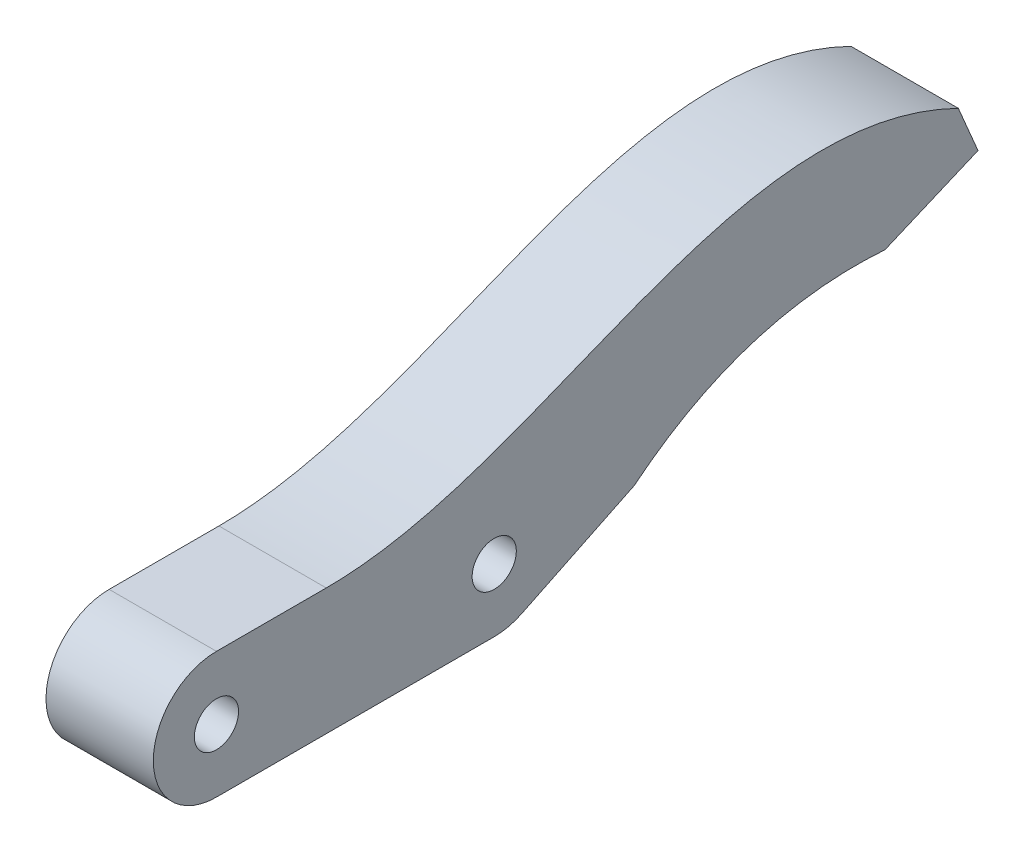
ISO-10303-21;
HEADER;
FILE_DESCRIPTION(('STEP AP214'),'2;1');
FILE_NAME('part.step','',(''),(''),'','','');
FILE_SCHEMA(('AUTOMOTIVE_DESIGN { 1 0 10303 214 1 1 1 1 }'));
ENDSEC;
DATA;
#1=APPLICATION_CONTEXT('core data for automotive mechanical design processes');
#2=APPLICATION_PROTOCOL_DEFINITION('international standard','automotive_design',2000,#1);
#3=PRODUCT_CONTEXT('',#1,'mechanical');
#4=PRODUCT('Part','Part','',(#3));
#5=PRODUCT_RELATED_PRODUCT_CATEGORY('part','',(#4));
#6=PRODUCT_DEFINITION_FORMATION('','',#4);
#7=PRODUCT_DEFINITION_CONTEXT('part definition',#1,'design');
#8=PRODUCT_DEFINITION('design','',#6,#7);
#9=PRODUCT_DEFINITION_SHAPE('','',#8);
#10=(LENGTH_UNIT() NAMED_UNIT(*) SI_UNIT(.MILLI.,.METRE.));
#11=(NAMED_UNIT(*) PLANE_ANGLE_UNIT() SI_UNIT($,.RADIAN.));
#12=(NAMED_UNIT(*) SI_UNIT($,.STERADIAN.) SOLID_ANGLE_UNIT());
#13=UNCERTAINTY_MEASURE_WITH_UNIT(LENGTH_MEASURE(1.E-05),#10,'distance_accuracy_value','');
#14=(GEOMETRIC_REPRESENTATION_CONTEXT(3) GLOBAL_UNCERTAINTY_ASSIGNED_CONTEXT((#13)) GLOBAL_UNIT_ASSIGNED_CONTEXT((#10,
#11,#12)) REPRESENTATION_CONTEXT('',''));
#15=CARTESIAN_POINT('',(0.,0.,0.));
#16=DIRECTION('',(0.,0.,1.));
#17=DIRECTION('',(1.,0.,0.));
#18=AXIS2_PLACEMENT_3D('',#15,#16,#17);
#19=CARTESIAN_POINT('',(8.5,5.,-27.));
#20=DIRECTION('',(-1.,0.,0.));
#21=DIRECTION('',(0.,0.,1.));
#22=AXIS2_PLACEMENT_3D('',#19,#20,#21);
#23=CYLINDRICAL_SURFACE('',#22,5.);
#24=DIRECTION('',(1.,0.,0.));
#25=VECTOR('',#24,1.);
#26=CARTESIAN_POINT('',(0.,0.502127655445501,-29.1838370754458));
#27=LINE('',#26,#25);
#28=CARTESIAN_POINT('',(0.,0.502127655445501,-29.1838370754458));
#29=VERTEX_POINT('',#28);
#30=CARTESIAN_POINT('',(8.5,0.502127655445501,-29.1838370754458));
#31=VERTEX_POINT('',#30);
#32=EDGE_CURVE('E206',#29,#31,#27,.T.);
#33=ORIENTED_EDGE('',*,*,#32,.T.);
#34=CARTESIAN_POINT('',(8.5,5.,-27.));
#35=DIRECTION('',(1.,0.,0.));
#36=DIRECTION('',(0.,0.,-1.));
#37=AXIS2_PLACEMENT_3D('',#34,#35,#36);
#38=CIRCLE('',#37,5.);
#39=CARTESIAN_POINT('',(8.5,0.,-27.));
#40=VERTEX_POINT('',#39);
#41=EDGE_CURVE('E222',#40,#31,#38,.T.);
#42=ORIENTED_EDGE('',*,*,#41,.F.);
#43=DIRECTION('',(-1.,0.,0.));
#44=VECTOR('',#43,1.);
#45=CARTESIAN_POINT('',(8.5,0.,-27.));
#46=LINE('',#45,#44);
#47=CARTESIAN_POINT('',(0.,0.,-27.));
#48=VERTEX_POINT('',#47);
#49=EDGE_CURVE('E233',#40,#48,#46,.T.);
#50=ORIENTED_EDGE('',*,*,#49,.T.);
#51=CARTESIAN_POINT('',(0.,5.,-27.));
#52=DIRECTION('',(1.,0.,0.));
#53=DIRECTION('',(0.,0.,-1.));
#54=AXIS2_PLACEMENT_3D('',#51,#52,#53);
#55=CIRCLE('',#54,5.);
#56=EDGE_CURVE('E240',#48,#29,#55,.T.);
#57=ORIENTED_EDGE('',*,*,#56,.T.);
#58=EDGE_LOOP('',(#33,#42,#50,#57));
#59=FACE_BOUND('',#58,.T.);
#60=ADVANCED_FACE('F43',(#59),#23,.T.);
#61=CARTESIAN_POINT('',(8.5,10.,0.));
#62=DIRECTION('',(0.,1.,0.));
#63=DIRECTION('',(0.,0.,1.));
#64=AXIS2_PLACEMENT_3D('',#61,#62,#63);
#65=PLANE('',#64);
#66=DIRECTION('',(1.,0.,0.));
#67=VECTOR('',#66,1.);
#68=CARTESIAN_POINT('',(0.,10.,-13.6949747586838));
#69=LINE('',#68,#67);
#70=CARTESIAN_POINT('',(0.,10.,-13.6949747586838));
#71=VERTEX_POINT('',#70);
#72=CARTESIAN_POINT('',(8.5,10.,-13.6949747586838));
#73=VERTEX_POINT('',#72);
#74=EDGE_CURVE('E135',#71,#73,#69,.T.);
#75=ORIENTED_EDGE('',*,*,#74,.F.);
#76=DIRECTION('',(0.,0.,-1.));
#77=VECTOR('',#76,1.);
#78=CARTESIAN_POINT('',(0.,10.,0.));
#79=LINE('',#78,#77);
#80=CARTESIAN_POINT('',(0.,10.,-5.));
#81=VERTEX_POINT('',#80);
#82=EDGE_CURVE('E146',#81,#71,#79,.T.);
#83=ORIENTED_EDGE('',*,*,#82,.F.);
#84=DIRECTION('',(-1.,0.,0.));
#85=VECTOR('',#84,1.);
#86=CARTESIAN_POINT('',(8.5,10.,-5.));
#87=LINE('',#86,#85);
#88=CARTESIAN_POINT('',(8.5,10.,-5.));
#89=VERTEX_POINT('',#88);
#90=EDGE_CURVE('E11',#89,#81,#87,.T.);
#91=ORIENTED_EDGE('',*,*,#90,.F.);
#92=DIRECTION('',(0.,0.,-1.));
#93=VECTOR('',#92,1.);
#94=CARTESIAN_POINT('',(8.5,10.,0.));
#95=LINE('',#94,#93);
#96=EDGE_CURVE('E204',#89,#73,#95,.T.);
#97=ORIENTED_EDGE('',*,*,#96,.T.);
#98=EDGE_LOOP('',(#75,#83,#91,#97));
#99=FACE_BOUND('',#98,.T.);
#100=ADVANCED_FACE('F45',(#99),#65,.T.);
#101=CARTESIAN_POINT('',(8.5,5.,-5.));
#102=DIRECTION('',(-1.,0.,0.));
#103=DIRECTION('',(0.,0.,1.));
#104=AXIS2_PLACEMENT_3D('',#101,#102,#103);
#105=CYLINDRICAL_SURFACE('',#104,5.);
#106=CARTESIAN_POINT('',(0.,5.,-5.));
#107=DIRECTION('',(1.,0.,0.));
#108=DIRECTION('',(0.,0.,-1.));
#109=AXIS2_PLACEMENT_3D('',#106,#107,#108);
#110=CIRCLE('',#109,5.);
#111=CARTESIAN_POINT('',(0.,0.,-5.));
#112=VERTEX_POINT('',#111);
#113=EDGE_CURVE('E74',#81,#112,#110,.T.);
#114=ORIENTED_EDGE('',*,*,#113,.T.);
#115=DIRECTION('',(-1.,0.,0.));
#116=VECTOR('',#115,1.);
#117=CARTESIAN_POINT('',(8.5,0.,-5.));
#118=LINE('',#117,#116);
#119=CARTESIAN_POINT('',(8.5,0.,-5.));
#120=VERTEX_POINT('',#119);
#121=EDGE_CURVE('E53',#120,#112,#118,.T.);
#122=ORIENTED_EDGE('',*,*,#121,.F.);
#123=CARTESIAN_POINT('',(8.5,5.,-5.));
#124=DIRECTION('',(1.,0.,0.));
#125=DIRECTION('',(0.,0.,-1.));
#126=AXIS2_PLACEMENT_3D('',#123,#124,#125);
#127=CIRCLE('',#126,5.);
#128=EDGE_CURVE('E217',#89,#120,#127,.T.);
#129=ORIENTED_EDGE('',*,*,#128,.F.);
#130=ORIENTED_EDGE('',*,*,#90,.T.);
#131=EDGE_LOOP('',(#114,#122,#129,#130));
#132=FACE_BOUND('',#131,.T.);
#133=ADVANCED_FACE('F196',(#132),#105,.T.);
#134=CARTESIAN_POINT('',(8.5,0.,0.));
#135=DIRECTION('',(0.,1.,0.));
#136=DIRECTION('',(0.,0.,1.));
#137=AXIS2_PLACEMENT_3D('',#134,#135,#136);
#138=PLANE('',#137);
#139=DIRECTION('',(0.,0.,-1.));
#140=VECTOR('',#139,1.);
#141=CARTESIAN_POINT('',(0.,0.,0.));
#142=LINE('',#141,#140);
#143=EDGE_CURVE('E79',#112,#48,#142,.T.);
#144=ORIENTED_EDGE('',*,*,#143,.T.);
#145=ORIENTED_EDGE('',*,*,#49,.F.);
#146=DIRECTION('',(0.,0.,-1.));
#147=VECTOR('',#146,1.);
#148=CARTESIAN_POINT('',(8.5,0.,0.));
#149=LINE('',#148,#147);
#150=EDGE_CURVE('E61',#120,#40,#149,.T.);
#151=ORIENTED_EDGE('',*,*,#150,.F.);
#152=ORIENTED_EDGE('',*,*,#121,.T.);
#153=EDGE_LOOP('',(#144,#145,#151,#152));
#154=FACE_BOUND('',#153,.T.);
#155=ADVANCED_FACE('F190',(#154),#138,.F.);
#156=CARTESIAN_POINT('',(8.5,5.,-5.));
#157=DIRECTION('',(-1.,0.,0.));
#158=DIRECTION('',(0.,0.,1.));
#159=AXIS2_PLACEMENT_3D('',#156,#157,#158);
#160=CYLINDRICAL_SURFACE('',#159,1.75);
#161=CARTESIAN_POINT('',(8.5,5.,-5.));
#162=DIRECTION('',(1.,0.,0.));
#163=DIRECTION('',(0.,0.,-1.));
#164=AXIS2_PLACEMENT_3D('',#161,#162,#163);
#165=CIRCLE('',#164,1.75);
#166=CARTESIAN_POINT('',(8.5,5.,-6.75));
#167=VERTEX_POINT('',#166);
#168=EDGE_CURVE('E225',#167,#167,#165,.T.);
#169=ORIENTED_EDGE('',*,*,#168,.T.);
#170=EDGE_LOOP('',(#169));
#171=FACE_BOUND('',#170,.T.);
#172=CARTESIAN_POINT('',(0.,5.,-5.));
#173=DIRECTION('',(1.,0.,0.));
#174=DIRECTION('',(0.,0.,-1.));
#175=AXIS2_PLACEMENT_3D('',#172,#173,#174);
#176=CIRCLE('',#175,1.75);
#177=CARTESIAN_POINT('',(0.,5.,-6.75));
#178=VERTEX_POINT('',#177);
#179=EDGE_CURVE('E243',#178,#178,#176,.T.);
#180=ORIENTED_EDGE('',*,*,#179,.F.);
#181=EDGE_LOOP('',(#180));
#182=FACE_BOUND('',#181,.T.);
#183=ADVANCED_FACE('F186',(#171,#182),#160,.F.);
#184=CARTESIAN_POINT('',(8.5,5.,-27.));
#185=DIRECTION('',(-1.,0.,0.));
#186=DIRECTION('',(0.,0.,1.));
#187=AXIS2_PLACEMENT_3D('',#184,#185,#186);
#188=CYLINDRICAL_SURFACE('',#187,1.75);
#189=CARTESIAN_POINT('',(8.5,5.,-27.));
#190=DIRECTION('',(1.,0.,0.));
#191=DIRECTION('',(0.,0.,-1.));
#192=AXIS2_PLACEMENT_3D('',#189,#190,#191);
#193=CIRCLE('',#192,1.75);
#194=CARTESIAN_POINT('',(8.5,5.,-28.75));
#195=VERTEX_POINT('',#194);
#196=EDGE_CURVE('E229',#195,#195,#193,.T.);
#197=ORIENTED_EDGE('',*,*,#196,.T.);
#198=EDGE_LOOP('',(#197));
#199=FACE_BOUND('',#198,.T.);
#200=CARTESIAN_POINT('',(0.,5.,-27.));
#201=DIRECTION('',(1.,0.,0.));
#202=DIRECTION('',(0.,0.,-1.));
#203=AXIS2_PLACEMENT_3D('',#200,#201,#202);
#204=CIRCLE('',#203,1.75);
#205=CARTESIAN_POINT('',(0.,5.,-28.75));
#206=VERTEX_POINT('',#205);
#207=EDGE_CURVE('E218',#206,#206,#204,.T.);
#208=ORIENTED_EDGE('',*,*,#207,.F.);
#209=EDGE_LOOP('',(#208));
#210=FACE_BOUND('',#209,.T.);
#211=ADVANCED_FACE('F181',(#199,#210),#188,.F.);
#212=CARTESIAN_POINT('',(8.5,0.,0.));
#213=DIRECTION('',(1.,0.,0.));
#214=DIRECTION('',(0.,0.,-1.));
#215=AXIS2_PLACEMENT_3D('',#212,#213,#214);
#216=PLANE('',#215);
#217=ORIENTED_EDGE('',*,*,#96,.F.);
#218=ORIENTED_EDGE('',*,*,#128,.T.);
#219=ORIENTED_EDGE('',*,*,#150,.T.);
#220=ORIENTED_EDGE('',*,*,#41,.T.);
#221=DIRECTION('',(0.,0.436767415089167,-0.8995744689109));
#222=VECTOR('',#221,1.);
#223=CARTESIAN_POINT('',(8.5,-11.0601312365663,-5.36998891997289));
#224=LINE('',#223,#222);
#225=CARTESIAN_POINT('',(8.5,4.82408407678908,-38.0854206599091));
#226=VERTEX_POINT('',#225);
#227=EDGE_CURVE('E261',#31,#226,#224,.T.);
#228=ORIENTED_EDGE('',*,*,#227,.T.);
#229=CARTESIAN_POINT('',(8.5,4.82408407678908,-38.0854206599091));
#230=CARTESIAN_POINT('',(8.5,11.8952224566425,-46.7975095094647));
#231=CARTESIAN_POINT('',(8.5,11.0678436667493,-57.9480004086976));
#232=B_SPLINE_CURVE_WITH_KNOTS('',2,(#229,#230,#231),.UNSPECIFIED.,.F.,.F.,(3,3),(0.,1.),.UNSPECIFIED.);
#233=CARTESIAN_POINT('',(8.5,11.0678436667493,-57.9480004086976));
#234=VERTEX_POINT('',#233);
#235=EDGE_CURVE('E159',#226,#234,#232,.T.);
#236=ORIENTED_EDGE('',*,*,#235,.T.);
#237=DIRECTION('',(0.,0.39020935118337,-0.920726160293631));
#238=VECTOR('',#237,1.);
#239=CARTESIAN_POINT('',(8.5,-11.4367064909869,-4.84694582599828));
#240=LINE('',#239,#238);
#241=CARTESIAN_POINT('',(8.5,14.1895184762162,-65.3138096910467));
#242=VERTEX_POINT('',#241);
#243=EDGE_CURVE('E153',#234,#242,#240,.T.);
#244=ORIENTED_EDGE('',*,*,#243,.T.);
#245=DIRECTION('',(0.,0.920726160293631,0.39020935118337));
#246=VECTOR('',#245,1.);
#247=CARTESIAN_POINT('',(8.5,25.6262249672031,-60.4668638650484));
#248=LINE('',#247,#246);
#249=CARTESIAN_POINT('',(8.5,17.8724231173908,-63.7529722863132));
#250=VERTEX_POINT('',#249);
#251=EDGE_CURVE('E269',#242,#250,#248,.T.);
#252=ORIENTED_EDGE('',*,*,#251,.T.);
#253=CARTESIAN_POINT('',(8.5,17.8724231173908,-63.7529722863132));
#254=CARTESIAN_POINT('',(8.5,26.563787962677,-45.9288826779558));
#255=CARTESIAN_POINT('',(8.5,10.,-31.059268620705));
#256=CARTESIAN_POINT('',(8.5,10.,-13.6949747586838));
#257=B_SPLINE_CURVE_WITH_KNOTS('',3,(#253,#254,#255,#256),.UNSPECIFIED.,.F.,.F.,(4,4),(0.,1.),.UNSPECIFIED.);
#258=EDGE_CURVE('E129',#250,#73,#257,.T.);
#259=ORIENTED_EDGE('',*,*,#258,.T.);
#260=EDGE_LOOP('',(#217,#218,#219,#220,#228,#236,#244,#252,#259));
#261=FACE_BOUND('',#260,.T.);
#262=ORIENTED_EDGE('',*,*,#168,.F.);
#263=EDGE_LOOP('',(#262));
#264=FACE_BOUND('',#263,.T.);
#265=ORIENTED_EDGE('',*,*,#196,.F.);
#266=EDGE_LOOP('',(#265));
#267=FACE_BOUND('',#266,.T.);
#268=ADVANCED_FACE('F178',(#261,#264,#267),#216,.T.);
#269=CARTESIAN_POINT('',(0.,0.,0.));
#270=DIRECTION('',(1.,0.,0.));
#271=DIRECTION('',(0.,0.,-1.));
#272=AXIS2_PLACEMENT_3D('',#269,#270,#271);
#273=PLANE('',#272);
#274=ORIENTED_EDGE('',*,*,#82,.T.);
#275=CARTESIAN_POINT('',(0.,17.8724231173908,-63.7529722863132));
#276=CARTESIAN_POINT('',(0.,26.563787962677,-45.9288826779558));
#277=CARTESIAN_POINT('',(0.,10.,-31.059268620705));
#278=CARTESIAN_POINT('',(0.,10.,-13.6949747586838));
#279=B_SPLINE_CURVE_WITH_KNOTS('',3,(#275,#276,#277,#278),.UNSPECIFIED.,.F.,.F.,(4,4),(0.,1.),.UNSPECIFIED.);
#280=CARTESIAN_POINT('',(0.,17.8724231173908,-63.7529722863132));
#281=VERTEX_POINT('',#280);
#282=EDGE_CURVE('E126',#281,#71,#279,.T.);
#283=ORIENTED_EDGE('',*,*,#282,.F.);
#284=DIRECTION('',(0.,0.920726160293631,0.39020935118337));
#285=VECTOR('',#284,1.);
#286=CARTESIAN_POINT('',(0.,25.6262249672031,-60.4668638650484));
#287=LINE('',#286,#285);
#288=CARTESIAN_POINT('',(0.,14.1895184762162,-65.3138096910467));
#289=VERTEX_POINT('',#288);
#290=EDGE_CURVE('E144',#289,#281,#287,.T.);
#291=ORIENTED_EDGE('',*,*,#290,.F.);
#292=DIRECTION('',(0.,0.39020935118337,-0.920726160293631));
#293=VECTOR('',#292,1.);
#294=CARTESIAN_POINT('',(0.,-11.4367064909869,-4.84694582599828));
#295=LINE('',#294,#293);
#296=CARTESIAN_POINT('',(0.,11.0678436667493,-57.9480004086976));
#297=VERTEX_POINT('',#296);
#298=EDGE_CURVE('E136',#297,#289,#295,.T.);
#299=ORIENTED_EDGE('',*,*,#298,.F.);
#300=CARTESIAN_POINT('',(0.,4.82408407678908,-38.0854206599091));
#301=CARTESIAN_POINT('',(0.,11.8952224566425,-46.7975095094647));
#302=CARTESIAN_POINT('',(0.,11.0678436667493,-57.9480004086976));
#303=B_SPLINE_CURVE_WITH_KNOTS('',2,(#300,#301,#302),.UNSPECIFIED.,.F.,.F.,(3,3),(0.,1.),.UNSPECIFIED.);
#304=CARTESIAN_POINT('',(0.,4.82408407678908,-38.0854206599091));
#305=VERTEX_POINT('',#304);
#306=EDGE_CURVE('E288',#305,#297,#303,.T.);
#307=ORIENTED_EDGE('',*,*,#306,.F.);
#308=DIRECTION('',(0.,0.436767415089167,-0.8995744689109));
#309=VECTOR('',#308,1.);
#310=CARTESIAN_POINT('',(0.,-11.0601312365663,-5.36998891997289));
#311=LINE('',#310,#309);
#312=EDGE_CURVE('E148',#29,#305,#311,.T.);
#313=ORIENTED_EDGE('',*,*,#312,.F.);
#314=ORIENTED_EDGE('',*,*,#56,.F.);
#315=ORIENTED_EDGE('',*,*,#143,.F.);
#316=ORIENTED_EDGE('',*,*,#113,.F.);
#317=EDGE_LOOP('',(#274,#283,#291,#299,#307,#313,#314,#315,#316));
#318=FACE_BOUND('',#317,.T.);
#319=ORIENTED_EDGE('',*,*,#179,.T.);
#320=EDGE_LOOP('',(#319));
#321=FACE_BOUND('',#320,.T.);
#322=ORIENTED_EDGE('',*,*,#207,.T.);
#323=EDGE_LOOP('',(#322));
#324=FACE_BOUND('',#323,.T.);
#325=ADVANCED_FACE('F141',(#318,#321,#324),#273,.F.);
#326=CARTESIAN_POINT('',(0.,25.6262249672031,-60.4668638650484));
#327=DIRECTION('',(0.,0.39020935118337,-0.920726160293631));
#328=DIRECTION('',(0.,0.920726160293631,0.39020935118337));
#329=AXIS2_PLACEMENT_3D('',#326,#327,#328);
#330=PLANE('',#329);
#331=ORIENTED_EDGE('',*,*,#251,.F.);
#332=DIRECTION('',(1.,0.,0.));
#333=VECTOR('',#332,1.);
#334=CARTESIAN_POINT('',(0.,14.1895184762162,-65.3138096910467));
#335=LINE('',#334,#333);
#336=EDGE_CURVE('E151',#289,#242,#335,.T.);
#337=ORIENTED_EDGE('',*,*,#336,.F.);
#338=ORIENTED_EDGE('',*,*,#290,.T.);
#339=DIRECTION('',(1.,0.,0.));
#340=VECTOR('',#339,1.);
#341=CARTESIAN_POINT('',(0.,17.8724231173908,-63.7529722863132));
#342=LINE('',#341,#340);
#343=EDGE_CURVE('E123',#281,#250,#342,.T.);
#344=ORIENTED_EDGE('',*,*,#343,.T.);
#345=EDGE_LOOP('',(#331,#337,#338,#344));
#346=FACE_BOUND('',#345,.T.);
#347=ADVANCED_FACE('F150',(#346),#330,.T.);
#348=CARTESIAN_POINT('',(0.,-11.4367064909869,-4.84694582599828));
#349=DIRECTION('',(0.,-0.920726160293631,-0.39020935118337));
#350=DIRECTION('',(0.,0.39020935118337,-0.920726160293631));
#351=AXIS2_PLACEMENT_3D('',#348,#349,#350);
#352=PLANE('',#351);
#353=ORIENTED_EDGE('',*,*,#243,.F.);
#354=DIRECTION('',(1.,0.,0.));
#355=VECTOR('',#354,1.);
#356=CARTESIAN_POINT('',(0.,11.0678436667493,-57.9480004086976));
#357=LINE('',#356,#355);
#358=EDGE_CURVE('E282',#297,#234,#357,.T.);
#359=ORIENTED_EDGE('',*,*,#358,.F.);
#360=ORIENTED_EDGE('',*,*,#298,.T.);
#361=ORIENTED_EDGE('',*,*,#336,.T.);
#362=EDGE_LOOP('',(#353,#359,#360,#361));
#363=FACE_BOUND('',#362,.T.);
#364=ADVANCED_FACE('F177',(#363),#352,.T.);
#365=DIRECTION('',(1.,0.,0.));
#366=VECTOR('',#365,1.);
#367=SURFACE_OF_LINEAR_EXTRUSION('',#303,#366);
#368=ORIENTED_EDGE('',*,*,#235,.F.);
#369=DIRECTION('',(1.,0.,0.));
#370=VECTOR('',#369,1.);
#371=CARTESIAN_POINT('',(0.,4.82408407678908,-38.0854206599091));
#372=LINE('',#371,#370);
#373=EDGE_CURVE('E211',#305,#226,#372,.T.);
#374=ORIENTED_EDGE('',*,*,#373,.F.);
#375=ORIENTED_EDGE('',*,*,#306,.T.);
#376=ORIENTED_EDGE('',*,*,#358,.T.);
#377=EDGE_LOOP('',(#368,#374,#375,#376));
#378=FACE_BOUND('',#377,.T.);
#379=ADVANCED_FACE('F287',(#378),#367,.T.);
#380=CARTESIAN_POINT('',(0.,-11.0601312365663,-5.36998891997289));
#381=DIRECTION('',(0.,-0.8995744689109,-0.436767415089167));
#382=DIRECTION('',(0.,0.436767415089167,-0.8995744689109));
#383=AXIS2_PLACEMENT_3D('',#380,#381,#382);
#384=PLANE('',#383);
#385=ORIENTED_EDGE('',*,*,#227,.F.);
#386=ORIENTED_EDGE('',*,*,#32,.F.);
#387=ORIENTED_EDGE('',*,*,#312,.T.);
#388=ORIENTED_EDGE('',*,*,#373,.T.);
#389=EDGE_LOOP('',(#385,#386,#387,#388));
#390=FACE_BOUND('',#389,.T.);
#391=ADVANCED_FACE('F173',(#390),#384,.T.);
#392=DIRECTION('',(1.,0.,0.));
#393=VECTOR('',#392,1.);
#394=SURFACE_OF_LINEAR_EXTRUSION('',#279,#393);
#395=ORIENTED_EDGE('',*,*,#258,.F.);
#396=ORIENTED_EDGE('',*,*,#343,.F.);
#397=ORIENTED_EDGE('',*,*,#282,.T.);
#398=ORIENTED_EDGE('',*,*,#74,.T.);
#399=EDGE_LOOP('',(#395,#396,#397,#398));
#400=FACE_BOUND('',#399,.T.);
#401=ADVANCED_FACE('F125',(#400),#394,.T.);
#402=CLOSED_SHELL('',(#60,#100,#133,#155,#183,#211,#268,#325,#347,#364,#379,#391,#401));
#403=MANIFOLD_SOLID_BREP('B2',#402);
#404=ADVANCED_BREP_SHAPE_REPRESENTATION('',(#18,#403),#14);
#405=SHAPE_DEFINITION_REPRESENTATION(#9,#404);
ENDSEC;
END-ISO-10303-21;
